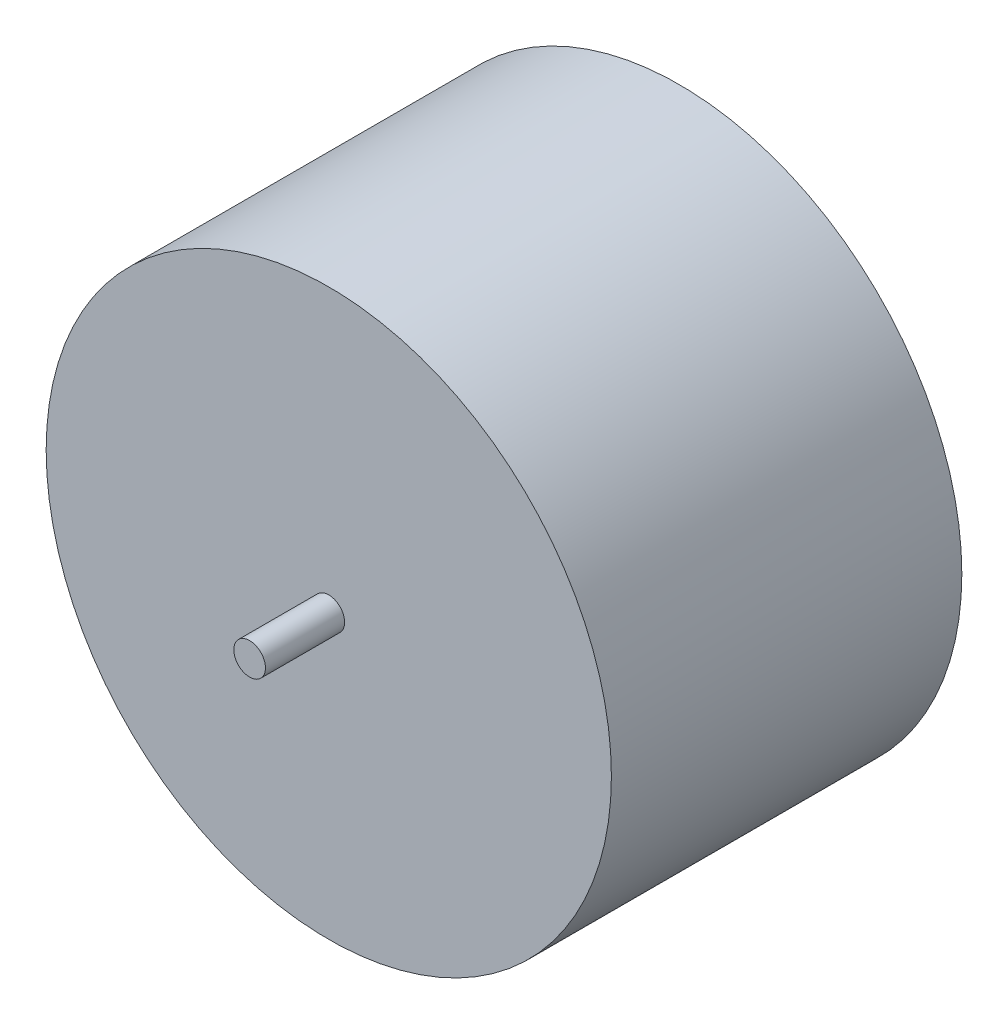
ISO-10303-21;
HEADER;
FILE_DESCRIPTION(('STEP AP214'),'2;1');
FILE_NAME('part.step','',(''),(''),'','','');
FILE_SCHEMA(('AUTOMOTIVE_DESIGN { 1 0 10303 214 1 1 1 1 }'));
ENDSEC;
DATA;
#1=APPLICATION_CONTEXT('core data for automotive mechanical design processes');
#2=APPLICATION_PROTOCOL_DEFINITION('international standard','automotive_design',2000,#1);
#3=PRODUCT_CONTEXT('',#1,'mechanical');
#4=PRODUCT('Part','Part','',(#3));
#5=PRODUCT_RELATED_PRODUCT_CATEGORY('part','',(#4));
#6=PRODUCT_DEFINITION_FORMATION('','',#4);
#7=PRODUCT_DEFINITION_CONTEXT('part definition',#1,'design');
#8=PRODUCT_DEFINITION('design','',#6,#7);
#9=PRODUCT_DEFINITION_SHAPE('','',#8);
#10=(LENGTH_UNIT() NAMED_UNIT(*) SI_UNIT(.MILLI.,.METRE.));
#11=(NAMED_UNIT(*) PLANE_ANGLE_UNIT() SI_UNIT($,.RADIAN.));
#12=(NAMED_UNIT(*) SI_UNIT($,.STERADIAN.) SOLID_ANGLE_UNIT());
#13=UNCERTAINTY_MEASURE_WITH_UNIT(LENGTH_MEASURE(1.E-05),#10,'distance_accuracy_value','');
#14=(GEOMETRIC_REPRESENTATION_CONTEXT(3) GLOBAL_UNCERTAINTY_ASSIGNED_CONTEXT((#13)) GLOBAL_UNIT_ASSIGNED_CONTEXT((#10,
#11,#12)) REPRESENTATION_CONTEXT('',''));
#15=CARTESIAN_POINT('',(0.,0.,0.));
#16=DIRECTION('',(0.,0.,1.));
#17=DIRECTION('',(1.,0.,0.));
#18=AXIS2_PLACEMENT_3D('',#15,#16,#17);
#19=CARTESIAN_POINT('',(0.,0.,155.));
#20=DIRECTION('',(0.,0.,-1.));
#21=DIRECTION('',(-1.,0.,0.));
#22=AXIS2_PLACEMENT_3D('',#19,#20,#21);
#23=CYLINDRICAL_SURFACE('',#22,125.);
#24=CARTESIAN_POINT('',(0.,0.,155.));
#25=DIRECTION('',(0.,0.,1.));
#26=DIRECTION('',(1.,0.,0.));
#27=AXIS2_PLACEMENT_3D('',#24,#25,#26);
#28=CIRCLE('',#27,125.);
#29=CARTESIAN_POINT('',(125.,0.,155.));
#30=VERTEX_POINT('',#29);
#31=EDGE_CURVE('E41',#30,#30,#28,.T.);
#32=ORIENTED_EDGE('',*,*,#31,.F.);
#33=EDGE_LOOP('',(#32));
#34=FACE_BOUND('',#33,.T.);
#35=CARTESIAN_POINT('',(0.,0.,0.));
#36=DIRECTION('',(0.,0.,1.));
#37=DIRECTION('',(1.,0.,0.));
#38=AXIS2_PLACEMENT_3D('',#35,#36,#37);
#39=CIRCLE('',#38,125.);
#40=CARTESIAN_POINT('',(125.,0.,0.));
#41=VERTEX_POINT('',#40);
#42=EDGE_CURVE('E45',#41,#41,#39,.T.);
#43=ORIENTED_EDGE('',*,*,#42,.T.);
#44=EDGE_LOOP('',(#43));
#45=FACE_BOUND('',#44,.T.);
#46=ADVANCED_FACE('F35',(#34,#45),#23,.T.);
#47=CARTESIAN_POINT('',(0.,0.,155.));
#48=DIRECTION('',(0.,0.,1.));
#49=DIRECTION('',(1.,0.,0.));
#50=AXIS2_PLACEMENT_3D('',#47,#48,#49);
#51=PLANE('',#50);
#52=CARTESIAN_POINT('',(0.,0.,155.));
#53=DIRECTION('',(0.,0.,1.));
#54=DIRECTION('',(1.,0.,0.));
#55=AXIS2_PLACEMENT_3D('',#52,#53,#54);
#56=CIRCLE('',#55,7.);
#57=CARTESIAN_POINT('',(7.,0.,155.));
#58=VERTEX_POINT('',#57);
#59=EDGE_CURVE('E52',#58,#58,#56,.T.);
#60=ORIENTED_EDGE('',*,*,#59,.F.);
#61=EDGE_LOOP('',(#60));
#62=FACE_BOUND('',#61,.T.);
#63=ORIENTED_EDGE('',*,*,#31,.T.);
#64=EDGE_LOOP('',(#63));
#65=FACE_BOUND('',#64,.T.);
#66=ADVANCED_FACE('F76',(#62,#65),#51,.T.);
#67=CARTESIAN_POINT('',(0.,0.,0.));
#68=DIRECTION('',(0.,0.,1.));
#69=DIRECTION('',(1.,0.,0.));
#70=AXIS2_PLACEMENT_3D('',#67,#68,#69);
#71=PLANE('',#70);
#72=CARTESIAN_POINT('',(0.,0.,0.));
#73=DIRECTION('',(0.,0.,1.));
#74=DIRECTION('',(1.,0.,0.));
#75=AXIS2_PLACEMENT_3D('',#72,#73,#74);
#76=CIRCLE('',#75,7.);
#77=CARTESIAN_POINT('',(7.,0.,0.));
#78=VERTEX_POINT('',#77);
#79=EDGE_CURVE('E10',#78,#78,#76,.F.);
#80=ORIENTED_EDGE('',*,*,#79,.F.);
#81=EDGE_LOOP('',(#80));
#82=FACE_BOUND('',#81,.T.);
#83=ORIENTED_EDGE('',*,*,#42,.F.);
#84=EDGE_LOOP('',(#83));
#85=FACE_BOUND('',#84,.T.);
#86=ADVANCED_FACE('F81',(#82,#85),#71,.F.);
#87=CARTESIAN_POINT('',(0.,0.,190.));
#88=DIRECTION('',(0.,0.,-1.));
#89=DIRECTION('',(-1.,0.,0.));
#90=AXIS2_PLACEMENT_3D('',#87,#88,#89);
#91=CYLINDRICAL_SURFACE('',#90,7.);
#92=CARTESIAN_POINT('',(0.,0.,190.));
#93=DIRECTION('',(0.,0.,1.));
#94=DIRECTION('',(1.,0.,0.));
#95=AXIS2_PLACEMENT_3D('',#92,#93,#94);
#96=CIRCLE('',#95,7.);
#97=CARTESIAN_POINT('',(7.,0.,190.));
#98=VERTEX_POINT('',#97);
#99=EDGE_CURVE('E50',#98,#98,#96,.T.);
#100=ORIENTED_EDGE('',*,*,#99,.F.);
#101=EDGE_LOOP('',(#100));
#102=FACE_BOUND('',#101,.T.);
#103=ORIENTED_EDGE('',*,*,#59,.T.);
#104=EDGE_LOOP('',(#103));
#105=FACE_BOUND('',#104,.T.);
#106=ADVANCED_FACE('F72',(#102,#105),#91,.T.);
#107=CARTESIAN_POINT('',(0.,0.,190.));
#108=DIRECTION('',(0.,0.,1.));
#109=DIRECTION('',(1.,0.,0.));
#110=AXIS2_PLACEMENT_3D('',#107,#108,#109);
#111=PLANE('',#110);
#112=ORIENTED_EDGE('',*,*,#99,.T.);
#113=EDGE_LOOP('',(#112));
#114=FACE_BOUND('',#113,.T.);
#115=ADVANCED_FACE('F65',(#114),#111,.T.);
#116=CARTESIAN_POINT('',(0.,0.,-35.));
#117=DIRECTION('',(0.,0.,1.));
#118=DIRECTION('',(1.,0.,0.));
#119=AXIS2_PLACEMENT_3D('',#116,#117,#118);
#120=CYLINDRICAL_SURFACE('',#119,7.);
#121=CARTESIAN_POINT('',(0.,0.,-35.));
#122=DIRECTION('',(0.,0.,-1.));
#123=DIRECTION('',(-1.,0.,0.));
#124=AXIS2_PLACEMENT_3D('',#121,#122,#123);
#125=CIRCLE('',#124,7.);
#126=CARTESIAN_POINT('',(-7.,0.,-35.));
#127=VERTEX_POINT('',#126);
#128=EDGE_CURVE('E55',#127,#127,#125,.T.);
#129=ORIENTED_EDGE('',*,*,#128,.F.);
#130=EDGE_LOOP('',(#129));
#131=FACE_BOUND('',#130,.T.);
#132=ORIENTED_EDGE('',*,*,#79,.T.);
#133=EDGE_LOOP('',(#132));
#134=FACE_BOUND('',#133,.T.);
#135=ADVANCED_FACE('F63',(#131,#134),#120,.T.);
#136=CARTESIAN_POINT('',(0.,0.,-35.));
#137=DIRECTION('',(0.,0.,-1.));
#138=DIRECTION('',(-1.,0.,0.));
#139=AXIS2_PLACEMENT_3D('',#136,#137,#138);
#140=PLANE('',#139);
#141=ORIENTED_EDGE('',*,*,#128,.T.);
#142=EDGE_LOOP('',(#141));
#143=FACE_BOUND('',#142,.T.);
#144=ADVANCED_FACE('F61',(#143),#140,.T.);
#145=CLOSED_SHELL('',(#46,#66,#86,#106,#115,#135,#144));
#146=MANIFOLD_SOLID_BREP('B2',#145);
#147=ADVANCED_BREP_SHAPE_REPRESENTATION('',(#18,#146),#14);
#148=SHAPE_DEFINITION_REPRESENTATION(#9,#147);
ENDSEC;
END-ISO-10303-21;
